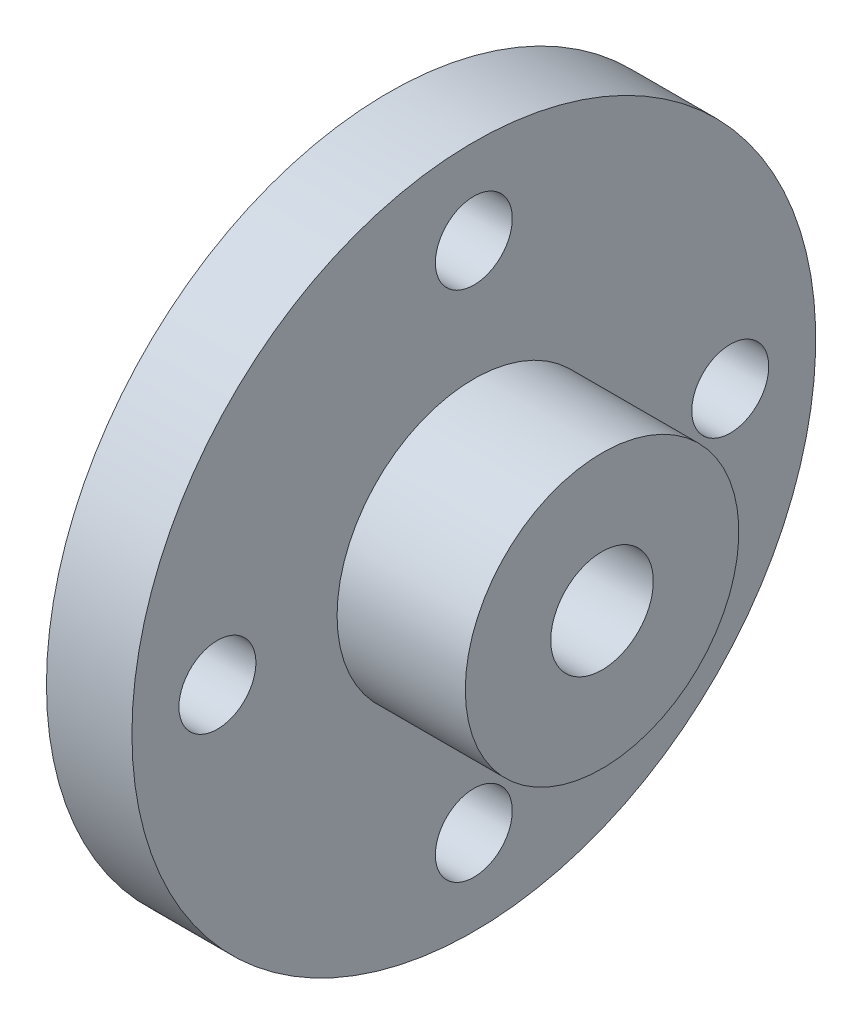
ISO-10303-21;
HEADER;
FILE_DESCRIPTION(('STEP AP214'),'2;1');
FILE_NAME('part.step','',(''),(''),'','','');
FILE_SCHEMA(('AUTOMOTIVE_DESIGN { 1 0 10303 214 1 1 1 1 }'));
ENDSEC;
DATA;
#1=APPLICATION_CONTEXT('core data for automotive mechanical design processes');
#2=APPLICATION_PROTOCOL_DEFINITION('international standard','automotive_design',2000,#1);
#3=PRODUCT_CONTEXT('',#1,'mechanical');
#4=PRODUCT('Part','Part','',(#3));
#5=PRODUCT_RELATED_PRODUCT_CATEGORY('part','',(#4));
#6=PRODUCT_DEFINITION_FORMATION('','',#4);
#7=PRODUCT_DEFINITION_CONTEXT('part definition',#1,'design');
#8=PRODUCT_DEFINITION('design','',#6,#7);
#9=PRODUCT_DEFINITION_SHAPE('','',#8);
#10=(LENGTH_UNIT() NAMED_UNIT(*) SI_UNIT(.MILLI.,.METRE.));
#11=(NAMED_UNIT(*) PLANE_ANGLE_UNIT() SI_UNIT($,.RADIAN.));
#12=(NAMED_UNIT(*) SI_UNIT($,.STERADIAN.) SOLID_ANGLE_UNIT());
#13=UNCERTAINTY_MEASURE_WITH_UNIT(LENGTH_MEASURE(1.E-05),#10,'distance_accuracy_value','');
#14=(GEOMETRIC_REPRESENTATION_CONTEXT(3) GLOBAL_UNCERTAINTY_ASSIGNED_CONTEXT((#13)) GLOBAL_UNIT_ASSIGNED_CONTEXT((#10,
#11,#12)) REPRESENTATION_CONTEXT('',''));
#15=CARTESIAN_POINT('',(0.,0.,0.));
#16=DIRECTION('',(0.,0.,1.));
#17=DIRECTION('',(1.,0.,0.));
#18=AXIS2_PLACEMENT_3D('',#15,#16,#17);
#19=CARTESIAN_POINT('',(-16.9594650205761,0.,0.));
#20=DIRECTION('',(-1.,0.,0.));
#21=DIRECTION('',(0.,0.,1.));
#22=AXIS2_PLACEMENT_3D('',#19,#20,#21);
#23=CYLINDRICAL_SURFACE('',#22,16.);
#24=CARTESIAN_POINT('',(0.,0.,0.));
#25=DIRECTION('',(-1.,0.,0.));
#26=DIRECTION('',(0.,0.,1.));
#27=AXIS2_PLACEMENT_3D('',#24,#25,#26);
#28=CIRCLE('',#27,16.);
#29=CARTESIAN_POINT('',(0.,0.,16.));
#30=VERTEX_POINT('',#29);
#31=EDGE_CURVE('E18',#30,#30,#28,.F.);
#32=ORIENTED_EDGE('',*,*,#31,.T.);
#33=EDGE_LOOP('',(#32));
#34=FACE_BOUND('',#33,.T.);
#35=CARTESIAN_POINT('',(15.,0.,0.));
#36=DIRECTION('',(-1.,0.,0.));
#37=DIRECTION('',(0.,0.,1.));
#38=AXIS2_PLACEMENT_3D('',#35,#36,#37);
#39=CIRCLE('',#38,16.);
#40=CARTESIAN_POINT('',(15.,0.,16.));
#41=VERTEX_POINT('',#40);
#42=EDGE_CURVE('E58',#41,#41,#39,.T.);
#43=ORIENTED_EDGE('',*,*,#42,.T.);
#44=EDGE_LOOP('',(#43));
#45=FACE_BOUND('',#44,.T.);
#46=ADVANCED_FACE('F15',(#34,#45),#23,.T.);
#47=CARTESIAN_POINT('',(0.,40.,0.));
#48=DIRECTION('',(-1.,0.,0.));
#49=DIRECTION('',(0.,0.,1.));
#50=AXIS2_PLACEMENT_3D('',#47,#48,#49);
#51=PLANE('',#50);
#52=CARTESIAN_POINT('',(0.,3.14233320495882E-13,-30.));
#53=DIRECTION('',(-1.,0.,0.));
#54=DIRECTION('',(0.,0.,1.));
#55=AXIS2_PLACEMENT_3D('',#52,#53,#54);
#56=CIRCLE('',#55,4.5);
#57=CARTESIAN_POINT('',(0.,3.14233320495882E-13,-25.5));
#58=VERTEX_POINT('',#57);
#59=EDGE_CURVE('E56',#58,#58,#56,.T.);
#60=ORIENTED_EDGE('',*,*,#59,.T.);
#61=EDGE_LOOP('',(#60));
#62=FACE_BOUND('',#61,.T.);
#63=CARTESIAN_POINT('',(0.,-1.04744440165294E-13,30.));
#64=DIRECTION('',(-1.,0.,0.));
#65=DIRECTION('',(0.,0.,1.));
#66=AXIS2_PLACEMENT_3D('',#63,#64,#65);
#67=CIRCLE('',#66,4.5);
#68=CARTESIAN_POINT('',(0.,-1.04744440165294E-13,34.5));
#69=VERTEX_POINT('',#68);
#70=EDGE_CURVE('E53',#69,#69,#67,.T.);
#71=ORIENTED_EDGE('',*,*,#70,.T.);
#72=EDGE_LOOP('',(#71));
#73=FACE_BOUND('',#72,.T.);
#74=ORIENTED_EDGE('',*,*,#31,.F.);
#75=EDGE_LOOP('',(#74));
#76=FACE_BOUND('',#75,.T.);
#77=CARTESIAN_POINT('',(0.,0.,0.));
#78=DIRECTION('',(-1.,0.,0.));
#79=DIRECTION('',(0.,0.,1.));
#80=AXIS2_PLACEMENT_3D('',#77,#78,#79);
#81=CIRCLE('',#80,40.);
#82=CARTESIAN_POINT('',(0.,0.,40.));
#83=VERTEX_POINT('',#82);
#84=EDGE_CURVE('E50',#83,#83,#81,.T.);
#85=ORIENTED_EDGE('',*,*,#84,.F.);
#86=EDGE_LOOP('',(#85));
#87=FACE_BOUND('',#86,.T.);
#88=CARTESIAN_POINT('',(0.,30.,0.));
#89=DIRECTION('',(-1.,0.,0.));
#90=DIRECTION('',(0.,0.,1.));
#91=AXIS2_PLACEMENT_3D('',#88,#89,#90);
#92=CIRCLE('',#91,4.5);
#93=CARTESIAN_POINT('',(0.,30.,4.5));
#94=VERTEX_POINT('',#93);
#95=EDGE_CURVE('E47',#94,#94,#92,.T.);
#96=ORIENTED_EDGE('',*,*,#95,.T.);
#97=EDGE_LOOP('',(#96));
#98=FACE_BOUND('',#97,.T.);
#99=CARTESIAN_POINT('',(0.,-30.,-2.09488880330588E-13));
#100=DIRECTION('',(-1.,0.,0.));
#101=DIRECTION('',(0.,0.,1.));
#102=AXIS2_PLACEMENT_3D('',#99,#100,#101);
#103=CIRCLE('',#102,4.5);
#104=CARTESIAN_POINT('',(0.,-30.,4.49999999999979));
#105=VERTEX_POINT('',#104);
#106=EDGE_CURVE('E44',#105,#105,#103,.T.);
#107=ORIENTED_EDGE('',*,*,#106,.T.);
#108=EDGE_LOOP('',(#107));
#109=FACE_BOUND('',#108,.T.);
#110=ADVANCED_FACE('F66',(#62,#73,#76,#87,#98,#109),#51,.F.);
#111=CARTESIAN_POINT('',(15.,16.,0.));
#112=DIRECTION('',(-1.,0.,0.));
#113=DIRECTION('',(0.,0.,1.));
#114=AXIS2_PLACEMENT_3D('',#111,#112,#113);
#115=PLANE('',#114);
#116=CARTESIAN_POINT('',(15.,0.,0.));
#117=DIRECTION('',(-1.,0.,0.));
#118=DIRECTION('',(0.,0.,1.));
#119=AXIS2_PLACEMENT_3D('',#116,#117,#118);
#120=CIRCLE('',#119,6.);
#121=CARTESIAN_POINT('',(15.,0.,6.));
#122=VERTEX_POINT('',#121);
#123=EDGE_CURVE('E41',#122,#122,#120,.T.);
#124=ORIENTED_EDGE('',*,*,#123,.T.);
#125=EDGE_LOOP('',(#124));
#126=FACE_BOUND('',#125,.T.);
#127=ORIENTED_EDGE('',*,*,#42,.F.);
#128=EDGE_LOOP('',(#127));
#129=FACE_BOUND('',#128,.T.);
#130=ADVANCED_FACE('F69',(#126,#129),#115,.F.);
#131=CARTESIAN_POINT('',(15.,3.14233320495882E-13,-30.));
#132=DIRECTION('',(-1.,0.,0.));
#133=DIRECTION('',(0.,0.,1.));
#134=AXIS2_PLACEMENT_3D('',#131,#132,#133);
#135=CYLINDRICAL_SURFACE('',#134,4.5);
#136=CARTESIAN_POINT('',(-9.99999999999999,3.14233320495882E-13,-30.));
#137=DIRECTION('',(-1.,0.,0.));
#138=DIRECTION('',(0.,0.,1.));
#139=AXIS2_PLACEMENT_3D('',#136,#137,#138);
#140=CIRCLE('',#139,4.5);
#141=CARTESIAN_POINT('',(-9.99999999999999,3.14233320495882E-13,-25.5));
#142=VERTEX_POINT('',#141);
#143=EDGE_CURVE('E38',#142,#142,#140,.T.);
#144=ORIENTED_EDGE('',*,*,#143,.T.);
#145=EDGE_LOOP('',(#144));
#146=FACE_BOUND('',#145,.T.);
#147=ORIENTED_EDGE('',*,*,#59,.F.);
#148=EDGE_LOOP('',(#147));
#149=FACE_BOUND('',#148,.T.);
#150=ADVANCED_FACE('F110',(#146,#149),#135,.F.);
#151=CARTESIAN_POINT('',(15.,-1.04744440165294E-13,30.));
#152=DIRECTION('',(-1.,0.,0.));
#153=DIRECTION('',(0.,0.,1.));
#154=AXIS2_PLACEMENT_3D('',#151,#152,#153);
#155=CYLINDRICAL_SURFACE('',#154,4.5);
#156=CARTESIAN_POINT('',(-9.99999999999999,-1.04744440165294E-13,30.));
#157=DIRECTION('',(-1.,0.,0.));
#158=DIRECTION('',(0.,0.,1.));
#159=AXIS2_PLACEMENT_3D('',#156,#157,#158);
#160=CIRCLE('',#159,4.5);
#161=CARTESIAN_POINT('',(-9.99999999999999,-1.04744440165294E-13,34.5));
#162=VERTEX_POINT('',#161);
#163=EDGE_CURVE('E35',#162,#162,#160,.T.);
#164=ORIENTED_EDGE('',*,*,#163,.T.);
#165=EDGE_LOOP('',(#164));
#166=FACE_BOUND('',#165,.T.);
#167=ORIENTED_EDGE('',*,*,#70,.F.);
#168=EDGE_LOOP('',(#167));
#169=FACE_BOUND('',#168,.T.);
#170=ADVANCED_FACE('F113',(#166,#169),#155,.F.);
#171=CARTESIAN_POINT('',(-16.9594650205761,0.,0.));
#172=DIRECTION('',(-1.,0.,0.));
#173=DIRECTION('',(0.,0.,1.));
#174=AXIS2_PLACEMENT_3D('',#171,#172,#173);
#175=CYLINDRICAL_SURFACE('',#174,40.);
#176=CARTESIAN_POINT('',(-9.99999999999999,0.,0.));
#177=DIRECTION('',(-1.,0.,0.));
#178=DIRECTION('',(0.,0.,1.));
#179=AXIS2_PLACEMENT_3D('',#176,#177,#178);
#180=CIRCLE('',#179,40.);
#181=CARTESIAN_POINT('',(-9.99999999999999,0.,40.));
#182=VERTEX_POINT('',#181);
#183=EDGE_CURVE('E32',#182,#182,#180,.F.);
#184=ORIENTED_EDGE('',*,*,#183,.T.);
#185=EDGE_LOOP('',(#184));
#186=FACE_BOUND('',#185,.T.);
#187=ORIENTED_EDGE('',*,*,#84,.T.);
#188=EDGE_LOOP('',(#187));
#189=FACE_BOUND('',#188,.T.);
#190=ADVANCED_FACE('F91',(#186,#189),#175,.T.);
#191=CARTESIAN_POINT('',(15.,30.,0.));
#192=DIRECTION('',(-1.,0.,0.));
#193=DIRECTION('',(0.,0.,1.));
#194=AXIS2_PLACEMENT_3D('',#191,#192,#193);
#195=CYLINDRICAL_SURFACE('',#194,4.5);
#196=CARTESIAN_POINT('',(-9.99999999999999,30.,0.));
#197=DIRECTION('',(-1.,0.,0.));
#198=DIRECTION('',(0.,0.,1.));
#199=AXIS2_PLACEMENT_3D('',#196,#197,#198);
#200=CIRCLE('',#199,4.5);
#201=CARTESIAN_POINT('',(-9.99999999999999,30.,4.5));
#202=VERTEX_POINT('',#201);
#203=EDGE_CURVE('E27',#202,#202,#200,.T.);
#204=ORIENTED_EDGE('',*,*,#203,.T.);
#205=EDGE_LOOP('',(#204));
#206=FACE_BOUND('',#205,.T.);
#207=ORIENTED_EDGE('',*,*,#95,.F.);
#208=EDGE_LOOP('',(#207));
#209=FACE_BOUND('',#208,.T.);
#210=ADVANCED_FACE('F80',(#206,#209),#195,.F.);
#211=CARTESIAN_POINT('',(15.,-30.,-2.09488880330588E-13));
#212=DIRECTION('',(-1.,0.,0.));
#213=DIRECTION('',(0.,0.,1.));
#214=AXIS2_PLACEMENT_3D('',#211,#212,#213);
#215=CYLINDRICAL_SURFACE('',#214,4.5);
#216=CARTESIAN_POINT('',(-9.99999999999999,-30.,-2.09488880330588E-13));
#217=DIRECTION('',(-1.,0.,0.));
#218=DIRECTION('',(0.,0.,1.));
#219=AXIS2_PLACEMENT_3D('',#216,#217,#218);
#220=CIRCLE('',#219,4.5);
#221=CARTESIAN_POINT('',(-9.99999999999999,-30.,4.49999999999979));
#222=VERTEX_POINT('',#221);
#223=EDGE_CURVE('E22',#222,#222,#220,.T.);
#224=ORIENTED_EDGE('',*,*,#223,.T.);
#225=EDGE_LOOP('',(#224));
#226=FACE_BOUND('',#225,.T.);
#227=ORIENTED_EDGE('',*,*,#106,.F.);
#228=EDGE_LOOP('',(#227));
#229=FACE_BOUND('',#228,.T.);
#230=ADVANCED_FACE('F77',(#226,#229),#215,.F.);
#231=CARTESIAN_POINT('',(-9.48503389009925,0.,0.));
#232=DIRECTION('',(-1.,0.,0.));
#233=DIRECTION('',(0.,0.,1.));
#234=AXIS2_PLACEMENT_3D('',#231,#232,#233);
#235=CYLINDRICAL_SURFACE('',#234,6.);
#236=ORIENTED_EDGE('',*,*,#123,.F.);
#237=EDGE_LOOP('',(#236));
#238=FACE_BOUND('',#237,.T.);
#239=CARTESIAN_POINT('',(-9.99999999999999,0.,0.));
#240=DIRECTION('',(-1.,0.,0.));
#241=DIRECTION('',(0.,0.,1.));
#242=AXIS2_PLACEMENT_3D('',#239,#240,#241);
#243=CIRCLE('',#242,6.);
#244=CARTESIAN_POINT('',(-9.99999999999999,0.,6.));
#245=VERTEX_POINT('',#244);
#246=EDGE_CURVE('E10',#245,#245,#243,.T.);
#247=ORIENTED_EDGE('',*,*,#246,.T.);
#248=EDGE_LOOP('',(#247));
#249=FACE_BOUND('',#248,.T.);
#250=ADVANCED_FACE('F79',(#238,#249),#235,.F.);
#251=CARTESIAN_POINT('',(-9.99999999999999,0.,0.));
#252=DIRECTION('',(1.,0.,0.));
#253=DIRECTION('',(0.,0.,-1.));
#254=AXIS2_PLACEMENT_3D('',#251,#252,#253);
#255=PLANE('',#254);
#256=ORIENTED_EDGE('',*,*,#246,.F.);
#257=EDGE_LOOP('',(#256));
#258=FACE_BOUND('',#257,.T.);
#259=ORIENTED_EDGE('',*,*,#223,.F.);
#260=EDGE_LOOP('',(#259));
#261=FACE_BOUND('',#260,.T.);
#262=ORIENTED_EDGE('',*,*,#203,.F.);
#263=EDGE_LOOP('',(#262));
#264=FACE_BOUND('',#263,.T.);
#265=ORIENTED_EDGE('',*,*,#183,.F.);
#266=EDGE_LOOP('',(#265));
#267=FACE_BOUND('',#266,.T.);
#268=ORIENTED_EDGE('',*,*,#163,.F.);
#269=EDGE_LOOP('',(#268));
#270=FACE_BOUND('',#269,.T.);
#271=ORIENTED_EDGE('',*,*,#143,.F.);
#272=EDGE_LOOP('',(#271));
#273=FACE_BOUND('',#272,.T.);
#274=ADVANCED_FACE('F88',(#258,#261,#264,#267,#270,#273),#255,.F.);
#275=CLOSED_SHELL('',(#46,#110,#130,#150,#170,#190,#210,#230,#250,#274));
#276=MANIFOLD_SOLID_BREP('B1',#275);
#277=ADVANCED_BREP_SHAPE_REPRESENTATION('',(#18,#276),#14);
#278=SHAPE_DEFINITION_REPRESENTATION(#9,#277);
ENDSEC;
END-ISO-10303-21;
